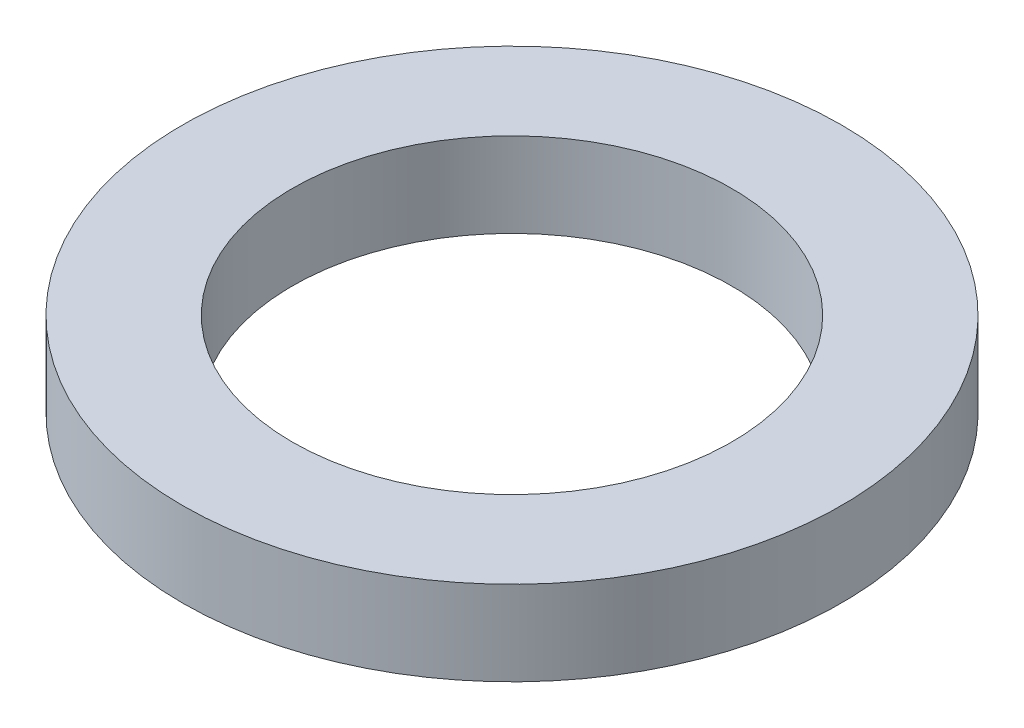
ISO-10303-21;
HEADER;
FILE_DESCRIPTION(('STEP AP214'),'2;1');
FILE_NAME('part.step','',(''),(''),'','','');
FILE_SCHEMA(('AUTOMOTIVE_DESIGN { 1 0 10303 214 1 1 1 1 }'));
ENDSEC;
DATA;
#1=APPLICATION_CONTEXT('core data for automotive mechanical design processes');
#2=APPLICATION_PROTOCOL_DEFINITION('international standard','automotive_design',2000,#1);
#3=PRODUCT_CONTEXT('',#1,'mechanical');
#4=PRODUCT('Part','Part','',(#3));
#5=PRODUCT_RELATED_PRODUCT_CATEGORY('part','',(#4));
#6=PRODUCT_DEFINITION_FORMATION('','',#4);
#7=PRODUCT_DEFINITION_CONTEXT('part definition',#1,'design');
#8=PRODUCT_DEFINITION('design','',#6,#7);
#9=PRODUCT_DEFINITION_SHAPE('','',#8);
#10=(LENGTH_UNIT() NAMED_UNIT(*) SI_UNIT(.MILLI.,.METRE.));
#11=(NAMED_UNIT(*) PLANE_ANGLE_UNIT() SI_UNIT($,.RADIAN.));
#12=(NAMED_UNIT(*) SI_UNIT($,.STERADIAN.) SOLID_ANGLE_UNIT());
#13=UNCERTAINTY_MEASURE_WITH_UNIT(LENGTH_MEASURE(1.E-05),#10,'distance_accuracy_value','');
#14=(GEOMETRIC_REPRESENTATION_CONTEXT(3) GLOBAL_UNCERTAINTY_ASSIGNED_CONTEXT((#13)) GLOBAL_UNIT_ASSIGNED_CONTEXT((#10,
#11,#12)) REPRESENTATION_CONTEXT('',''));
#15=CARTESIAN_POINT('',(0.,0.,0.));
#16=DIRECTION('',(0.,0.,1.));
#17=DIRECTION('',(1.,0.,0.));
#18=AXIS2_PLACEMENT_3D('',#15,#16,#17);
#19=CARTESIAN_POINT('',(0.,2.5,0.));
#20=DIRECTION('',(0.,1.,0.));
#21=DIRECTION('',(0.,0.,1.));
#22=AXIS2_PLACEMENT_3D('',#19,#20,#21);
#23=PLANE('',#22);
#24=CARTESIAN_POINT('',(0.,2.5,0.));
#25=DIRECTION('',(0.,1.,0.));
#26=DIRECTION('',(0.,0.,1.));
#27=AXIS2_PLACEMENT_3D('',#24,#25,#26);
#28=CIRCLE('',#27,9.75);
#29=CARTESIAN_POINT('',(0.,2.5,9.75));
#30=VERTEX_POINT('',#29);
#31=EDGE_CURVE('E10',#30,#30,#28,.T.);
#32=ORIENTED_EDGE('',*,*,#31,.T.);
#33=EDGE_LOOP('',(#32));
#34=FACE_BOUND('',#33,.T.);
#35=CARTESIAN_POINT('',(0.,2.5,0.));
#36=DIRECTION('',(0.,1.,0.));
#37=DIRECTION('',(0.,0.,1.));
#38=AXIS2_PLACEMENT_3D('',#35,#36,#37);
#39=CIRCLE('',#38,6.5);
#40=CARTESIAN_POINT('',(0.,2.5,6.5));
#41=VERTEX_POINT('',#40);
#42=EDGE_CURVE('E45',#41,#41,#39,.T.);
#43=ORIENTED_EDGE('',*,*,#42,.F.);
#44=EDGE_LOOP('',(#43));
#45=FACE_BOUND('',#44,.T.);
#46=ADVANCED_FACE('F34',(#34,#45),#23,.T.);
#47=CARTESIAN_POINT('',(0.,0.,0.));
#48=DIRECTION('',(0.,1.,0.));
#49=DIRECTION('',(0.,0.,1.));
#50=AXIS2_PLACEMENT_3D('',#47,#48,#49);
#51=PLANE('',#50);
#52=CARTESIAN_POINT('',(0.,0.,0.));
#53=DIRECTION('',(0.,1.,0.));
#54=DIRECTION('',(0.,0.,1.));
#55=AXIS2_PLACEMENT_3D('',#52,#53,#54);
#56=CIRCLE('',#55,9.75);
#57=CARTESIAN_POINT('',(0.,0.,9.75));
#58=VERTEX_POINT('',#57);
#59=EDGE_CURVE('E38',#58,#58,#56,.T.);
#60=ORIENTED_EDGE('',*,*,#59,.F.);
#61=EDGE_LOOP('',(#60));
#62=FACE_BOUND('',#61,.T.);
#63=CARTESIAN_POINT('',(0.,0.,0.));
#64=DIRECTION('',(0.,1.,0.));
#65=DIRECTION('',(0.,0.,1.));
#66=AXIS2_PLACEMENT_3D('',#63,#64,#65);
#67=CIRCLE('',#66,6.5);
#68=CARTESIAN_POINT('',(0.,0.,6.5));
#69=VERTEX_POINT('',#68);
#70=EDGE_CURVE('E47',#69,#69,#67,.T.);
#71=ORIENTED_EDGE('',*,*,#70,.T.);
#72=EDGE_LOOP('',(#71));
#73=FACE_BOUND('',#72,.T.);
#74=ADVANCED_FACE('F57',(#62,#73),#51,.F.);
#75=CARTESIAN_POINT('',(0.,2.5,0.));
#76=DIRECTION('',(0.,-1.,0.));
#77=DIRECTION('',(0.,0.,-1.));
#78=AXIS2_PLACEMENT_3D('',#75,#76,#77);
#79=CYLINDRICAL_SURFACE('',#78,9.75);
#80=ORIENTED_EDGE('',*,*,#31,.F.);
#81=EDGE_LOOP('',(#80));
#82=FACE_BOUND('',#81,.T.);
#83=ORIENTED_EDGE('',*,*,#59,.T.);
#84=EDGE_LOOP('',(#83));
#85=FACE_BOUND('',#84,.T.);
#86=ADVANCED_FACE('F36',(#82,#85),#79,.T.);
#87=CARTESIAN_POINT('',(0.,2.5,0.));
#88=DIRECTION('',(0.,-1.,0.));
#89=DIRECTION('',(0.,0.,-1.));
#90=AXIS2_PLACEMENT_3D('',#87,#88,#89);
#91=CYLINDRICAL_SURFACE('',#90,6.5);
#92=ORIENTED_EDGE('',*,*,#42,.T.);
#93=EDGE_LOOP('',(#92));
#94=FACE_BOUND('',#93,.T.);
#95=ORIENTED_EDGE('',*,*,#70,.F.);
#96=EDGE_LOOP('',(#95));
#97=FACE_BOUND('',#96,.T.);
#98=ADVANCED_FACE('F53',(#94,#97),#91,.F.);
#99=CLOSED_SHELL('',(#46,#74,#86,#98));
#100=MANIFOLD_SOLID_BREP('B2',#99);
#101=ADVANCED_BREP_SHAPE_REPRESENTATION('',(#18,#100),#14);
#102=SHAPE_DEFINITION_REPRESENTATION(#9,#101);
ENDSEC;
END-ISO-10303-21;
